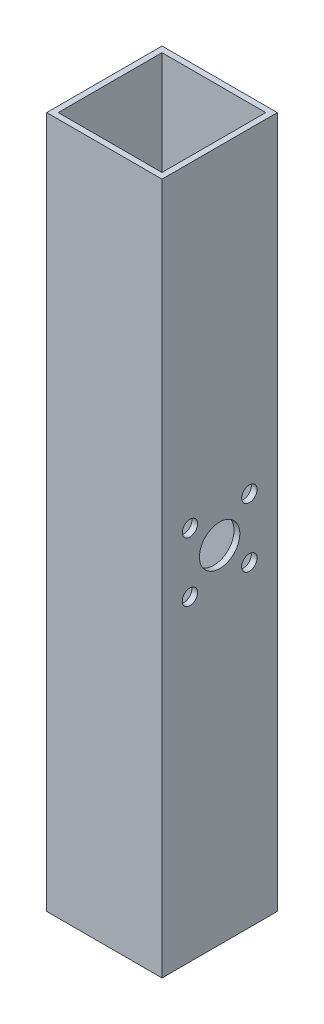
ISO-10303-21;
HEADER;
FILE_DESCRIPTION(('STEP AP214'),'2;1');
FILE_NAME('part.step','',(''),(''),'','','');
FILE_SCHEMA(('AUTOMOTIVE_DESIGN { 1 0 10303 214 1 1 1 1 }'));
ENDSEC;
DATA;
#1=APPLICATION_CONTEXT('core data for automotive mechanical design processes');
#2=APPLICATION_PROTOCOL_DEFINITION('international standard','automotive_design',2000,#1);
#3=PRODUCT_CONTEXT('',#1,'mechanical');
#4=PRODUCT('Part','Part','',(#3));
#5=PRODUCT_RELATED_PRODUCT_CATEGORY('part','',(#4));
#6=PRODUCT_DEFINITION_FORMATION('','',#4);
#7=PRODUCT_DEFINITION_CONTEXT('part definition',#1,'design');
#8=PRODUCT_DEFINITION('design','',#6,#7);
#9=PRODUCT_DEFINITION_SHAPE('','',#8);
#10=(LENGTH_UNIT() NAMED_UNIT(*) SI_UNIT(.MILLI.,.METRE.));
#11=(NAMED_UNIT(*) PLANE_ANGLE_UNIT() SI_UNIT($,.RADIAN.));
#12=(NAMED_UNIT(*) SI_UNIT($,.STERADIAN.) SOLID_ANGLE_UNIT());
#13=UNCERTAINTY_MEASURE_WITH_UNIT(LENGTH_MEASURE(1.E-05),#10,'distance_accuracy_value','');
#14=(GEOMETRIC_REPRESENTATION_CONTEXT(3) GLOBAL_UNCERTAINTY_ASSIGNED_CONTEXT((#13)) GLOBAL_UNIT_ASSIGNED_CONTEXT((#10,
#11,#12)) REPRESENTATION_CONTEXT('',''));
#15=CARTESIAN_POINT('',(0.,0.,0.));
#16=DIRECTION('',(0.,0.,1.));
#17=DIRECTION('',(1.,0.,0.));
#18=AXIS2_PLACEMENT_3D('',#15,#16,#17);
#19=CARTESIAN_POINT('',(0.,457.2,0.));
#20=DIRECTION('',(0.,-1.,0.));
#21=DIRECTION('',(0.,0.,-1.));
#22=AXIS2_PLACEMENT_3D('',#19,#20,#21);
#23=PLANE('',#22);
#24=DIRECTION('',(0.,0.,1.));
#25=VECTOR('',#24,1.);
#26=CARTESIAN_POINT('',(0.,457.2,0.));
#27=LINE('',#26,#25);
#28=CARTESIAN_POINT('',(0.,457.2,-76.2));
#29=VERTEX_POINT('',#28);
#30=CARTESIAN_POINT('',(0.,457.2,0.));
#31=VERTEX_POINT('',#30);
#32=EDGE_CURVE('E161',#29,#31,#27,.T.);
#33=ORIENTED_EDGE('',*,*,#32,.T.);
#34=DIRECTION('',(1.,0.,0.));
#35=VECTOR('',#34,1.);
#36=CARTESIAN_POINT('',(0.,457.2,0.));
#37=LINE('',#36,#35);
#38=CARTESIAN_POINT('',(76.2,457.2,0.));
#39=VERTEX_POINT('',#38);
#40=EDGE_CURVE('E165',#31,#39,#37,.T.);
#41=ORIENTED_EDGE('',*,*,#40,.T.);
#42=DIRECTION('',(0.,0.,-1.));
#43=VECTOR('',#42,1.);
#44=CARTESIAN_POINT('',(76.2,457.2,0.));
#45=LINE('',#44,#43);
#46=CARTESIAN_POINT('',(76.2,457.2,-76.2));
#47=VERTEX_POINT('',#46);
#48=EDGE_CURVE('E169',#39,#47,#45,.T.);
#49=ORIENTED_EDGE('',*,*,#48,.T.);
#50=DIRECTION('',(-1.,0.,0.));
#51=VECTOR('',#50,1.);
#52=CARTESIAN_POINT('',(0.,457.2,-76.2));
#53=LINE('',#52,#51);
#54=EDGE_CURVE('E172',#47,#29,#53,.T.);
#55=ORIENTED_EDGE('',*,*,#54,.T.);
#56=EDGE_LOOP('',(#33,#41,#49,#55));
#57=FACE_BOUND('',#56,.T.);
#58=DIRECTION('',(0.,0.,1.));
#59=VECTOR('',#58,1.);
#60=CARTESIAN_POINT('',(3.81,457.2,-3.81));
#61=LINE('',#60,#59);
#62=CARTESIAN_POINT('',(3.81,457.2,-72.39));
#63=VERTEX_POINT('',#62);
#64=CARTESIAN_POINT('',(3.81,457.2,-3.81));
#65=VERTEX_POINT('',#64);
#66=EDGE_CURVE('E111',#63,#65,#61,.T.);
#67=ORIENTED_EDGE('',*,*,#66,.F.);
#68=DIRECTION('',(-1.,0.,0.));
#69=VECTOR('',#68,1.);
#70=CARTESIAN_POINT('',(3.81,457.2,-72.39));
#71=LINE('',#70,#69);
#72=CARTESIAN_POINT('',(72.39,457.2,-72.39));
#73=VERTEX_POINT('',#72);
#74=EDGE_CURVE('E137',#73,#63,#71,.T.);
#75=ORIENTED_EDGE('',*,*,#74,.F.);
#76=DIRECTION('',(0.,0.,-1.));
#77=VECTOR('',#76,1.);
#78=CARTESIAN_POINT('',(72.39,457.2,-3.81));
#79=LINE('',#78,#77);
#80=CARTESIAN_POINT('',(72.39,457.2,-3.81));
#81=VERTEX_POINT('',#80);
#82=EDGE_CURVE('E133',#81,#73,#79,.T.);
#83=ORIENTED_EDGE('',*,*,#82,.F.);
#84=DIRECTION('',(1.,0.,0.));
#85=VECTOR('',#84,1.);
#86=CARTESIAN_POINT('',(3.81,457.2,-3.81));
#87=LINE('',#86,#85);
#88=EDGE_CURVE('E120',#65,#81,#87,.T.);
#89=ORIENTED_EDGE('',*,*,#88,.F.);
#90=EDGE_LOOP('',(#67,#75,#83,#89));
#91=FACE_BOUND('',#90,.T.);
#92=ADVANCED_FACE('F43',(#57,#91),#23,.F.);
#93=CARTESIAN_POINT('',(0.,0.,0.));
#94=DIRECTION('',(0.,-1.,0.));
#95=DIRECTION('',(0.,0.,-1.));
#96=AXIS2_PLACEMENT_3D('',#93,#94,#95);
#97=PLANE('',#96);
#98=DIRECTION('',(0.,0.,1.));
#99=VECTOR('',#98,1.);
#100=CARTESIAN_POINT('',(0.,0.,0.));
#101=LINE('',#100,#99);
#102=CARTESIAN_POINT('',(0.,0.,-76.2));
#103=VERTEX_POINT('',#102);
#104=CARTESIAN_POINT('',(0.,0.,0.));
#105=VERTEX_POINT('',#104);
#106=EDGE_CURVE('E129',#103,#105,#101,.T.);
#107=ORIENTED_EDGE('',*,*,#106,.F.);
#108=DIRECTION('',(-1.,0.,0.));
#109=VECTOR('',#108,1.);
#110=CARTESIAN_POINT('',(0.,0.,-76.2));
#111=LINE('',#110,#109);
#112=CARTESIAN_POINT('',(76.2,0.,-76.2));
#113=VERTEX_POINT('',#112);
#114=EDGE_CURVE('E166',#113,#103,#111,.T.);
#115=ORIENTED_EDGE('',*,*,#114,.F.);
#116=DIRECTION('',(0.,0.,-1.));
#117=VECTOR('',#116,1.);
#118=CARTESIAN_POINT('',(76.2,0.,0.));
#119=LINE('',#118,#117);
#120=CARTESIAN_POINT('',(76.2,0.,0.));
#121=VERTEX_POINT('',#120);
#122=EDGE_CURVE('E182',#121,#113,#119,.T.);
#123=ORIENTED_EDGE('',*,*,#122,.F.);
#124=DIRECTION('',(1.,0.,0.));
#125=VECTOR('',#124,1.);
#126=CARTESIAN_POINT('',(0.,0.,0.));
#127=LINE('',#126,#125);
#128=EDGE_CURVE('E179',#105,#121,#127,.T.);
#129=ORIENTED_EDGE('',*,*,#128,.F.);
#130=EDGE_LOOP('',(#107,#115,#123,#129));
#131=FACE_BOUND('',#130,.T.);
#132=DIRECTION('',(-1.,0.,0.));
#133=VECTOR('',#132,1.);
#134=CARTESIAN_POINT('',(3.81,0.,-72.39));
#135=LINE('',#134,#133);
#136=CARTESIAN_POINT('',(72.39,0.,-72.39));
#137=VERTEX_POINT('',#136);
#138=CARTESIAN_POINT('',(3.81,0.,-72.39));
#139=VERTEX_POINT('',#138);
#140=EDGE_CURVE('E121',#137,#139,#135,.T.);
#141=ORIENTED_EDGE('',*,*,#140,.T.);
#142=DIRECTION('',(0.,0.,1.));
#143=VECTOR('',#142,1.);
#144=CARTESIAN_POINT('',(3.81,0.,-3.81));
#145=LINE('',#144,#143);
#146=CARTESIAN_POINT('',(3.81,0.,-3.81));
#147=VERTEX_POINT('',#146);
#148=EDGE_CURVE('E69',#139,#147,#145,.T.);
#149=ORIENTED_EDGE('',*,*,#148,.T.);
#150=DIRECTION('',(1.,0.,0.));
#151=VECTOR('',#150,1.);
#152=CARTESIAN_POINT('',(3.81,0.,-3.81));
#153=LINE('',#152,#151);
#154=CARTESIAN_POINT('',(72.39,0.,-3.81));
#155=VERTEX_POINT('',#154);
#156=EDGE_CURVE('E127',#147,#155,#153,.T.);
#157=ORIENTED_EDGE('',*,*,#156,.T.);
#158=DIRECTION('',(0.,0.,-1.));
#159=VECTOR('',#158,1.);
#160=CARTESIAN_POINT('',(72.39,0.,-3.81));
#161=LINE('',#160,#159);
#162=EDGE_CURVE('E148',#155,#137,#161,.T.);
#163=ORIENTED_EDGE('',*,*,#162,.T.);
#164=EDGE_LOOP('',(#141,#149,#157,#163));
#165=FACE_BOUND('',#164,.T.);
#166=ADVANCED_FACE('F274',(#131,#165),#97,.T.);
#167=CARTESIAN_POINT('',(0.,457.2,0.));
#168=DIRECTION('',(1.,0.,0.));
#169=DIRECTION('',(0.,0.,-1.));
#170=AXIS2_PLACEMENT_3D('',#167,#168,#169);
#171=PLANE('',#170);
#172=CARTESIAN_POINT('',(0.,248.242411839042,-18.4575881609583));
#173=DIRECTION('',(-1.,0.,0.));
#174=DIRECTION('',(0.,0.,1.));
#175=AXIS2_PLACEMENT_3D('',#172,#173,#174);
#176=CIRCLE('',#175,5.07999999999999);
#177=CARTESIAN_POINT('',(0.,248.242411839042,-13.3775881609583));
#178=VERTEX_POINT('',#177);
#179=EDGE_CURVE('E343',#178,#178,#176,.T.);
#180=ORIENTED_EDGE('',*,*,#179,.F.);
#181=EDGE_LOOP('',(#180));
#182=FACE_BOUND('',#181,.T.);
#183=CARTESIAN_POINT('',(0.,208.957588160958,-57.7424118390417));
#184=DIRECTION('',(-1.,0.,0.));
#185=DIRECTION('',(0.,0.,1.));
#186=AXIS2_PLACEMENT_3D('',#183,#184,#185);
#187=CIRCLE('',#186,5.08);
#188=CARTESIAN_POINT('',(0.,208.957588160958,-52.6624118390417));
#189=VERTEX_POINT('',#188);
#190=EDGE_CURVE('E344',#189,#189,#187,.T.);
#191=ORIENTED_EDGE('',*,*,#190,.F.);
#192=EDGE_LOOP('',(#191));
#193=FACE_BOUND('',#192,.T.);
#194=CARTESIAN_POINT('',(0.,208.957588160958,-18.4575881609583));
#195=DIRECTION('',(-1.,0.,0.));
#196=DIRECTION('',(0.,0.,1.));
#197=AXIS2_PLACEMENT_3D('',#194,#195,#196);
#198=CIRCLE('',#197,5.07999999999999);
#199=CARTESIAN_POINT('',(0.,208.957588160958,-13.3775881609583));
#200=VERTEX_POINT('',#199);
#201=EDGE_CURVE('E348',#200,#200,#198,.T.);
#202=ORIENTED_EDGE('',*,*,#201,.F.);
#203=EDGE_LOOP('',(#202));
#204=FACE_BOUND('',#203,.T.);
#205=CARTESIAN_POINT('',(0.,248.242411839042,-57.7424118390417));
#206=DIRECTION('',(-1.,0.,0.));
#207=DIRECTION('',(0.,0.,1.));
#208=AXIS2_PLACEMENT_3D('',#205,#206,#207);
#209=CIRCLE('',#208,5.08);
#210=CARTESIAN_POINT('',(0.,248.242411839042,-52.6624118390417));
#211=VERTEX_POINT('',#210);
#212=EDGE_CURVE('E208',#211,#211,#209,.T.);
#213=ORIENTED_EDGE('',*,*,#212,.F.);
#214=EDGE_LOOP('',(#213));
#215=FACE_BOUND('',#214,.T.);
#216=CARTESIAN_POINT('',(0.,228.6,-38.1));
#217=DIRECTION('',(-1.,0.,0.));
#218=DIRECTION('',(0.,0.,1.));
#219=AXIS2_PLACEMENT_3D('',#216,#217,#218);
#220=CIRCLE('',#219,13.335);
#221=CARTESIAN_POINT('',(0.,228.6,-24.765));
#222=VERTEX_POINT('',#221);
#223=EDGE_CURVE('E202',#222,#222,#220,.T.);
#224=ORIENTED_EDGE('',*,*,#223,.F.);
#225=EDGE_LOOP('',(#224));
#226=FACE_BOUND('',#225,.T.);
#227=ORIENTED_EDGE('',*,*,#106,.T.);
#228=DIRECTION('',(0.,-1.,0.));
#229=VECTOR('',#228,1.);
#230=CARTESIAN_POINT('',(0.,457.2,0.));
#231=LINE('',#230,#229);
#232=EDGE_CURVE('E11',#31,#105,#231,.T.);
#233=ORIENTED_EDGE('',*,*,#232,.F.);
#234=ORIENTED_EDGE('',*,*,#32,.F.);
#235=DIRECTION('',(0.,-1.,0.));
#236=VECTOR('',#235,1.);
#237=CARTESIAN_POINT('',(0.,457.2,-76.2));
#238=LINE('',#237,#236);
#239=EDGE_CURVE('E175',#29,#103,#238,.T.);
#240=ORIENTED_EDGE('',*,*,#239,.T.);
#241=EDGE_LOOP('',(#227,#233,#234,#240));
#242=FACE_BOUND('',#241,.T.);
#243=ADVANCED_FACE('F45',(#182,#193,#204,#215,#226,#242),#171,.F.);
#244=CARTESIAN_POINT('',(0.,457.2,0.));
#245=DIRECTION('',(0.,0.,-1.));
#246=DIRECTION('',(-1.,0.,0.));
#247=AXIS2_PLACEMENT_3D('',#244,#245,#246);
#248=PLANE('',#247);
#249=ORIENTED_EDGE('',*,*,#128,.T.);
#250=DIRECTION('',(0.,-1.,0.));
#251=VECTOR('',#250,1.);
#252=CARTESIAN_POINT('',(76.2,457.2,0.));
#253=LINE('',#252,#251);
#254=EDGE_CURVE('E53',#39,#121,#253,.T.);
#255=ORIENTED_EDGE('',*,*,#254,.F.);
#256=ORIENTED_EDGE('',*,*,#40,.F.);
#257=ORIENTED_EDGE('',*,*,#232,.T.);
#258=EDGE_LOOP('',(#249,#255,#256,#257));
#259=FACE_BOUND('',#258,.T.);
#260=ADVANCED_FACE('F290',(#259),#248,.F.);
#261=CARTESIAN_POINT('',(76.2,457.2,0.));
#262=DIRECTION('',(-1.,0.,0.));
#263=DIRECTION('',(0.,0.,1.));
#264=AXIS2_PLACEMENT_3D('',#261,#262,#263);
#265=PLANE('',#264);
#266=CARTESIAN_POINT('',(76.2,248.242411839042,-18.4575881609583));
#267=DIRECTION('',(-1.,0.,0.));
#268=DIRECTION('',(0.,0.,1.));
#269=AXIS2_PLACEMENT_3D('',#266,#267,#268);
#270=CIRCLE('',#269,5.07999999999999);
#271=CARTESIAN_POINT('',(76.2,248.242411839042,-13.3775881609583));
#272=VERTEX_POINT('',#271);
#273=EDGE_CURVE('E242',#272,#272,#270,.T.);
#274=ORIENTED_EDGE('',*,*,#273,.T.);
#275=EDGE_LOOP('',(#274));
#276=FACE_BOUND('',#275,.T.);
#277=CARTESIAN_POINT('',(76.2,208.957588160958,-57.7424118390417));
#278=DIRECTION('',(-1.,0.,0.));
#279=DIRECTION('',(0.,0.,1.));
#280=AXIS2_PLACEMENT_3D('',#277,#278,#279);
#281=CIRCLE('',#280,5.08);
#282=CARTESIAN_POINT('',(76.2,208.957588160958,-52.6624118390417));
#283=VERTEX_POINT('',#282);
#284=EDGE_CURVE('E224',#283,#283,#281,.T.);
#285=ORIENTED_EDGE('',*,*,#284,.T.);
#286=EDGE_LOOP('',(#285));
#287=FACE_BOUND('',#286,.T.);
#288=CARTESIAN_POINT('',(76.2,208.957588160958,-18.4575881609583));
#289=DIRECTION('',(-1.,0.,0.));
#290=DIRECTION('',(0.,0.,1.));
#291=AXIS2_PLACEMENT_3D('',#288,#289,#290);
#292=CIRCLE('',#291,5.07999999999999);
#293=CARTESIAN_POINT('',(76.2,208.957588160958,-13.3775881609583));
#294=VERTEX_POINT('',#293);
#295=EDGE_CURVE('E218',#294,#294,#292,.T.);
#296=ORIENTED_EDGE('',*,*,#295,.T.);
#297=EDGE_LOOP('',(#296));
#298=FACE_BOUND('',#297,.T.);
#299=CARTESIAN_POINT('',(76.2,248.242411839042,-57.7424118390417));
#300=DIRECTION('',(-1.,0.,0.));
#301=DIRECTION('',(0.,0.,1.));
#302=AXIS2_PLACEMENT_3D('',#299,#300,#301);
#303=CIRCLE('',#302,5.08);
#304=CARTESIAN_POINT('',(76.2,248.242411839042,-52.6624118390417));
#305=VERTEX_POINT('',#304);
#306=EDGE_CURVE('E213',#305,#305,#303,.T.);
#307=ORIENTED_EDGE('',*,*,#306,.T.);
#308=EDGE_LOOP('',(#307));
#309=FACE_BOUND('',#308,.T.);
#310=CARTESIAN_POINT('',(76.2,228.6,-38.1));
#311=DIRECTION('',(-1.,0.,0.));
#312=DIRECTION('',(0.,0.,1.));
#313=AXIS2_PLACEMENT_3D('',#310,#311,#312);
#314=CIRCLE('',#313,13.335);
#315=CARTESIAN_POINT('',(76.2,228.6,-24.765));
#316=VERTEX_POINT('',#315);
#317=EDGE_CURVE('E145',#316,#316,#314,.T.);
#318=ORIENTED_EDGE('',*,*,#317,.T.);
#319=EDGE_LOOP('',(#318));
#320=FACE_BOUND('',#319,.T.);
#321=ORIENTED_EDGE('',*,*,#122,.T.);
#322=DIRECTION('',(0.,-1.,0.));
#323=VECTOR('',#322,1.);
#324=CARTESIAN_POINT('',(76.2,457.2,-76.2));
#325=LINE('',#324,#323);
#326=EDGE_CURVE('E190',#47,#113,#325,.T.);
#327=ORIENTED_EDGE('',*,*,#326,.F.);
#328=ORIENTED_EDGE('',*,*,#48,.F.);
#329=ORIENTED_EDGE('',*,*,#254,.T.);
#330=EDGE_LOOP('',(#321,#327,#328,#329));
#331=FACE_BOUND('',#330,.T.);
#332=ADVANCED_FACE('F255',(#276,#287,#298,#309,#320,#331),#265,.F.);
#333=CARTESIAN_POINT('',(0.,457.2,-76.2));
#334=DIRECTION('',(0.,0.,1.));
#335=DIRECTION('',(1.,0.,0.));
#336=AXIS2_PLACEMENT_3D('',#333,#334,#335);
#337=PLANE('',#336);
#338=ORIENTED_EDGE('',*,*,#114,.T.);
#339=ORIENTED_EDGE('',*,*,#239,.F.);
#340=ORIENTED_EDGE('',*,*,#54,.F.);
#341=ORIENTED_EDGE('',*,*,#326,.T.);
#342=EDGE_LOOP('',(#338,#339,#340,#341));
#343=FACE_BOUND('',#342,.T.);
#344=ADVANCED_FACE('F285',(#343),#337,.F.);
#345=CARTESIAN_POINT('',(3.81,457.2,-3.81));
#346=DIRECTION('',(1.,0.,0.));
#347=DIRECTION('',(0.,0.,-1.));
#348=AXIS2_PLACEMENT_3D('',#345,#346,#347);
#349=PLANE('',#348);
#350=CARTESIAN_POINT('',(3.80999999999998,248.242411839042,-18.4575881609583));
#351=DIRECTION('',(1.,0.,0.));
#352=DIRECTION('',(0.,0.,-1.));
#353=AXIS2_PLACEMENT_3D('',#350,#351,#352);
#354=CIRCLE('',#353,5.07999999999999);
#355=CARTESIAN_POINT('',(3.80999999999998,248.242411839042,-23.5375881609583));
#356=VERTEX_POINT('',#355);
#357=EDGE_CURVE('E238',#356,#356,#354,.T.);
#358=ORIENTED_EDGE('',*,*,#357,.F.);
#359=EDGE_LOOP('',(#358));
#360=FACE_BOUND('',#359,.T.);
#361=CARTESIAN_POINT('',(3.80999999999998,208.957588160958,-57.7424118390417));
#362=DIRECTION('',(1.,0.,0.));
#363=DIRECTION('',(0.,0.,-1.));
#364=AXIS2_PLACEMENT_3D('',#361,#362,#363);
#365=CIRCLE('',#364,5.08);
#366=CARTESIAN_POINT('',(3.80999999999998,208.957588160958,-62.8224118390417));
#367=VERTEX_POINT('',#366);
#368=EDGE_CURVE('E217',#367,#367,#365,.T.);
#369=ORIENTED_EDGE('',*,*,#368,.F.);
#370=EDGE_LOOP('',(#369));
#371=FACE_BOUND('',#370,.T.);
#372=CARTESIAN_POINT('',(3.80999999999998,208.957588160958,-18.4575881609583));
#373=DIRECTION('',(1.,0.,0.));
#374=DIRECTION('',(0.,0.,-1.));
#375=AXIS2_PLACEMENT_3D('',#372,#373,#374);
#376=CIRCLE('',#375,5.07999999999999);
#377=CARTESIAN_POINT('',(3.80999999999998,208.957588160958,-23.5375881609583));
#378=VERTEX_POINT('',#377);
#379=EDGE_CURVE('E212',#378,#378,#376,.T.);
#380=ORIENTED_EDGE('',*,*,#379,.F.);
#381=EDGE_LOOP('',(#380));
#382=FACE_BOUND('',#381,.T.);
#383=CARTESIAN_POINT('',(3.80999999999998,248.242411839042,-57.7424118390417));
#384=DIRECTION('',(1.,0.,0.));
#385=DIRECTION('',(0.,0.,-1.));
#386=AXIS2_PLACEMENT_3D('',#383,#384,#385);
#387=CIRCLE('',#386,5.08);
#388=CARTESIAN_POINT('',(3.80999999999998,248.242411839042,-62.8224118390417));
#389=VERTEX_POINT('',#388);
#390=EDGE_CURVE('E207',#389,#389,#387,.T.);
#391=ORIENTED_EDGE('',*,*,#390,.F.);
#392=EDGE_LOOP('',(#391));
#393=FACE_BOUND('',#392,.T.);
#394=CARTESIAN_POINT('',(3.80999999999998,228.6,-38.1));
#395=DIRECTION('',(1.,0.,0.));
#396=DIRECTION('',(0.,0.,-1.));
#397=AXIS2_PLACEMENT_3D('',#394,#395,#396);
#398=CIRCLE('',#397,13.335);
#399=CARTESIAN_POINT('',(3.80999999999998,228.6,-51.435));
#400=VERTEX_POINT('',#399);
#401=EDGE_CURVE('E201',#400,#400,#398,.T.);
#402=ORIENTED_EDGE('',*,*,#401,.F.);
#403=EDGE_LOOP('',(#402));
#404=FACE_BOUND('',#403,.T.);
#405=ORIENTED_EDGE('',*,*,#148,.F.);
#406=DIRECTION('',(0.,-1.,0.));
#407=VECTOR('',#406,1.);
#408=CARTESIAN_POINT('',(3.81,457.2,-72.39));
#409=LINE('',#408,#407);
#410=EDGE_CURVE('E115',#63,#139,#409,.T.);
#411=ORIENTED_EDGE('',*,*,#410,.F.);
#412=ORIENTED_EDGE('',*,*,#66,.T.);
#413=DIRECTION('',(0.,-1.,0.));
#414=VECTOR('',#413,1.);
#415=CARTESIAN_POINT('',(3.81,457.2,-3.81));
#416=LINE('',#415,#414);
#417=EDGE_CURVE('E114',#65,#147,#416,.T.);
#418=ORIENTED_EDGE('',*,*,#417,.T.);
#419=EDGE_LOOP('',(#405,#411,#412,#418));
#420=FACE_BOUND('',#419,.T.);
#421=ADVANCED_FACE('F113',(#360,#371,#382,#393,#404,#420),#349,.T.);
#422=CARTESIAN_POINT('',(3.81,457.2,-3.81));
#423=DIRECTION('',(0.,0.,-1.));
#424=DIRECTION('',(-1.,0.,0.));
#425=AXIS2_PLACEMENT_3D('',#422,#423,#424);
#426=PLANE('',#425);
#427=ORIENTED_EDGE('',*,*,#156,.F.);
#428=ORIENTED_EDGE('',*,*,#417,.F.);
#429=ORIENTED_EDGE('',*,*,#88,.T.);
#430=DIRECTION('',(0.,-1.,0.));
#431=VECTOR('',#430,1.);
#432=CARTESIAN_POINT('',(72.39,457.2,-3.81));
#433=LINE('',#432,#431);
#434=EDGE_CURVE('E130',#81,#155,#433,.T.);
#435=ORIENTED_EDGE('',*,*,#434,.T.);
#436=EDGE_LOOP('',(#427,#428,#429,#435));
#437=FACE_BOUND('',#436,.T.);
#438=ADVANCED_FACE('F124',(#437),#426,.T.);
#439=CARTESIAN_POINT('',(72.39,457.2,-3.81));
#440=DIRECTION('',(-1.,0.,0.));
#441=DIRECTION('',(0.,0.,1.));
#442=AXIS2_PLACEMENT_3D('',#439,#440,#441);
#443=PLANE('',#442);
#444=CARTESIAN_POINT('',(72.3900000000001,248.242411839042,-18.4575881609583));
#445=DIRECTION('',(-1.,0.,0.));
#446=DIRECTION('',(0.,0.,1.));
#447=AXIS2_PLACEMENT_3D('',#444,#445,#446);
#448=CIRCLE('',#447,5.07999999999999);
#449=CARTESIAN_POINT('',(72.3900000000001,248.242411839042,-13.3775881609583));
#450=VERTEX_POINT('',#449);
#451=EDGE_CURVE('E47',#450,#450,#448,.T.);
#452=ORIENTED_EDGE('',*,*,#451,.F.);
#453=EDGE_LOOP('',(#452));
#454=FACE_BOUND('',#453,.T.);
#455=CARTESIAN_POINT('',(72.3900000000001,208.957588160958,-57.7424118390417));
#456=DIRECTION('',(-1.,0.,0.));
#457=DIRECTION('',(0.,0.,1.));
#458=AXIS2_PLACEMENT_3D('',#455,#456,#457);
#459=CIRCLE('',#458,5.08);
#460=CARTESIAN_POINT('',(72.3900000000001,208.957588160958,-52.6624118390417));
#461=VERTEX_POINT('',#460);
#462=EDGE_CURVE('E214',#461,#461,#459,.T.);
#463=ORIENTED_EDGE('',*,*,#462,.F.);
#464=EDGE_LOOP('',(#463));
#465=FACE_BOUND('',#464,.T.);
#466=CARTESIAN_POINT('',(72.3900000000001,208.957588160958,-18.4575881609583));
#467=DIRECTION('',(-1.,0.,0.));
#468=DIRECTION('',(0.,0.,1.));
#469=AXIS2_PLACEMENT_3D('',#466,#467,#468);
#470=CIRCLE('',#469,5.07999999999999);
#471=CARTESIAN_POINT('',(72.3900000000001,208.957588160958,-13.3775881609583));
#472=VERTEX_POINT('',#471);
#473=EDGE_CURVE('E209',#472,#472,#470,.T.);
#474=ORIENTED_EDGE('',*,*,#473,.F.);
#475=EDGE_LOOP('',(#474));
#476=FACE_BOUND('',#475,.T.);
#477=CARTESIAN_POINT('',(72.3900000000001,248.242411839042,-57.7424118390417));
#478=DIRECTION('',(-1.,0.,0.));
#479=DIRECTION('',(0.,0.,1.));
#480=AXIS2_PLACEMENT_3D('',#477,#478,#479);
#481=CIRCLE('',#480,5.08);
#482=CARTESIAN_POINT('',(72.3900000000001,248.242411839042,-52.6624118390417));
#483=VERTEX_POINT('',#482);
#484=EDGE_CURVE('E203',#483,#483,#481,.T.);
#485=ORIENTED_EDGE('',*,*,#484,.F.);
#486=EDGE_LOOP('',(#485));
#487=FACE_BOUND('',#486,.T.);
#488=CARTESIAN_POINT('',(72.3900000000001,228.6,-38.1));
#489=DIRECTION('',(-1.,0.,0.));
#490=DIRECTION('',(0.,0.,1.));
#491=AXIS2_PLACEMENT_3D('',#488,#489,#490);
#492=CIRCLE('',#491,13.335);
#493=CARTESIAN_POINT('',(72.3900000000001,228.6,-24.765));
#494=VERTEX_POINT('',#493);
#495=EDGE_CURVE('E197',#494,#494,#492,.T.);
#496=ORIENTED_EDGE('',*,*,#495,.F.);
#497=EDGE_LOOP('',(#496));
#498=FACE_BOUND('',#497,.T.);
#499=ORIENTED_EDGE('',*,*,#162,.F.);
#500=ORIENTED_EDGE('',*,*,#434,.F.);
#501=ORIENTED_EDGE('',*,*,#82,.T.);
#502=DIRECTION('',(0.,-1.,0.));
#503=VECTOR('',#502,1.);
#504=CARTESIAN_POINT('',(72.39,457.2,-72.39));
#505=LINE('',#504,#503);
#506=EDGE_CURVE('E61',#73,#137,#505,.T.);
#507=ORIENTED_EDGE('',*,*,#506,.T.);
#508=EDGE_LOOP('',(#499,#500,#501,#507));
#509=FACE_BOUND('',#508,.T.);
#510=ADVANCED_FACE('F270',(#454,#465,#476,#487,#498,#509),#443,.T.);
#511=CARTESIAN_POINT('',(3.81,457.2,-72.39));
#512=DIRECTION('',(0.,0.,1.));
#513=DIRECTION('',(1.,0.,0.));
#514=AXIS2_PLACEMENT_3D('',#511,#512,#513);
#515=PLANE('',#514);
#516=ORIENTED_EDGE('',*,*,#140,.F.);
#517=ORIENTED_EDGE('',*,*,#506,.F.);
#518=ORIENTED_EDGE('',*,*,#74,.T.);
#519=ORIENTED_EDGE('',*,*,#410,.T.);
#520=EDGE_LOOP('',(#516,#517,#518,#519));
#521=FACE_BOUND('',#520,.T.);
#522=ADVANCED_FACE('F261',(#521),#515,.T.);
#523=CARTESIAN_POINT('',(914.4,228.6,-38.1));
#524=DIRECTION('',(-1.,0.,0.));
#525=DIRECTION('',(0.,0.,1.));
#526=AXIS2_PLACEMENT_3D('',#523,#524,#525);
#527=CYLINDRICAL_SURFACE('',#526,13.335);
#528=ORIENTED_EDGE('',*,*,#495,.T.);
#529=EDGE_LOOP('',(#528));
#530=FACE_BOUND('',#529,.T.);
#531=ORIENTED_EDGE('',*,*,#317,.F.);
#532=EDGE_LOOP('',(#531));
#533=FACE_BOUND('',#532,.T.);
#534=ADVANCED_FACE('F258',(#530,#533),#527,.F.);
#535=ORIENTED_EDGE('',*,*,#401,.T.);
#536=EDGE_LOOP('',(#535));
#537=FACE_BOUND('',#536,.T.);
#538=ORIENTED_EDGE('',*,*,#223,.T.);
#539=EDGE_LOOP('',(#538));
#540=FACE_BOUND('',#539,.T.);
#541=ADVANCED_FACE('F260',(#537,#540),#527,.F.);
#542=CARTESIAN_POINT('',(914.4,248.242411839042,-57.7424118390417));
#543=DIRECTION('',(-1.,0.,0.));
#544=DIRECTION('',(0.,0.,1.));
#545=AXIS2_PLACEMENT_3D('',#542,#543,#544);
#546=CYLINDRICAL_SURFACE('',#545,5.08);
#547=ORIENTED_EDGE('',*,*,#484,.T.);
#548=EDGE_LOOP('',(#547));
#549=FACE_BOUND('',#548,.T.);
#550=ORIENTED_EDGE('',*,*,#306,.F.);
#551=EDGE_LOOP('',(#550));
#552=FACE_BOUND('',#551,.T.);
#553=ADVANCED_FACE('F268',(#549,#552),#546,.F.);
#554=CARTESIAN_POINT('',(914.4,208.957588160958,-18.4575881609583));
#555=DIRECTION('',(-1.,0.,0.));
#556=DIRECTION('',(0.,0.,1.));
#557=AXIS2_PLACEMENT_3D('',#554,#555,#556);
#558=CYLINDRICAL_SURFACE('',#557,5.07999999999999);
#559=ORIENTED_EDGE('',*,*,#473,.T.);
#560=EDGE_LOOP('',(#559));
#561=FACE_BOUND('',#560,.T.);
#562=ORIENTED_EDGE('',*,*,#295,.F.);
#563=EDGE_LOOP('',(#562));
#564=FACE_BOUND('',#563,.T.);
#565=ADVANCED_FACE('F330',(#561,#564),#558,.F.);
#566=CARTESIAN_POINT('',(914.4,208.957588160958,-57.7424118390417));
#567=DIRECTION('',(-1.,0.,0.));
#568=DIRECTION('',(0.,0.,1.));
#569=AXIS2_PLACEMENT_3D('',#566,#567,#568);
#570=CYLINDRICAL_SURFACE('',#569,5.08);
#571=ORIENTED_EDGE('',*,*,#462,.T.);
#572=EDGE_LOOP('',(#571));
#573=FACE_BOUND('',#572,.T.);
#574=ORIENTED_EDGE('',*,*,#284,.F.);
#575=EDGE_LOOP('',(#574));
#576=FACE_BOUND('',#575,.T.);
#577=ADVANCED_FACE('F374',(#573,#576),#570,.F.);
#578=CARTESIAN_POINT('',(914.4,248.242411839042,-18.4575881609583));
#579=DIRECTION('',(-1.,0.,0.));
#580=DIRECTION('',(0.,0.,1.));
#581=AXIS2_PLACEMENT_3D('',#578,#579,#580);
#582=CYLINDRICAL_SURFACE('',#581,5.07999999999999);
#583=ORIENTED_EDGE('',*,*,#451,.T.);
#584=EDGE_LOOP('',(#583));
#585=FACE_BOUND('',#584,.T.);
#586=ORIENTED_EDGE('',*,*,#273,.F.);
#587=EDGE_LOOP('',(#586));
#588=FACE_BOUND('',#587,.T.);
#589=ADVANCED_FACE('F365',(#585,#588),#582,.F.);
#590=ORIENTED_EDGE('',*,*,#390,.T.);
#591=EDGE_LOOP('',(#590));
#592=FACE_BOUND('',#591,.T.);
#593=ORIENTED_EDGE('',*,*,#212,.T.);
#594=EDGE_LOOP('',(#593));
#595=FACE_BOUND('',#594,.T.);
#596=ADVANCED_FACE('F331',(#592,#595),#546,.F.);
#597=ORIENTED_EDGE('',*,*,#379,.T.);
#598=EDGE_LOOP('',(#597));
#599=FACE_BOUND('',#598,.T.);
#600=ORIENTED_EDGE('',*,*,#201,.T.);
#601=EDGE_LOOP('',(#600));
#602=FACE_BOUND('',#601,.T.);
#603=ADVANCED_FACE('F356',(#599,#602),#558,.F.);
#604=ORIENTED_EDGE('',*,*,#368,.T.);
#605=EDGE_LOOP('',(#604));
#606=FACE_BOUND('',#605,.T.);
#607=ORIENTED_EDGE('',*,*,#190,.T.);
#608=EDGE_LOOP('',(#607));
#609=FACE_BOUND('',#608,.T.);
#610=ADVANCED_FACE('F371',(#606,#609),#570,.F.);
#611=ORIENTED_EDGE('',*,*,#357,.T.);
#612=EDGE_LOOP('',(#611));
#613=FACE_BOUND('',#612,.T.);
#614=ORIENTED_EDGE('',*,*,#179,.T.);
#615=EDGE_LOOP('',(#614));
#616=FACE_BOUND('',#615,.T.);
#617=ADVANCED_FACE('F377',(#613,#616),#582,.F.);
#618=CLOSED_SHELL('',(#92,#166,#243,#260,#332,#344,#421,#438,#510,#522,#534,#541,#553,#565,#577,
#589,#596,#603,#610,#617));
#619=MANIFOLD_SOLID_BREP('B2',#618);
#620=ADVANCED_BREP_SHAPE_REPRESENTATION('',(#18,#619),#14);
#621=SHAPE_DEFINITION_REPRESENTATION(#9,#620);
ENDSEC;
END-ISO-10303-21;
